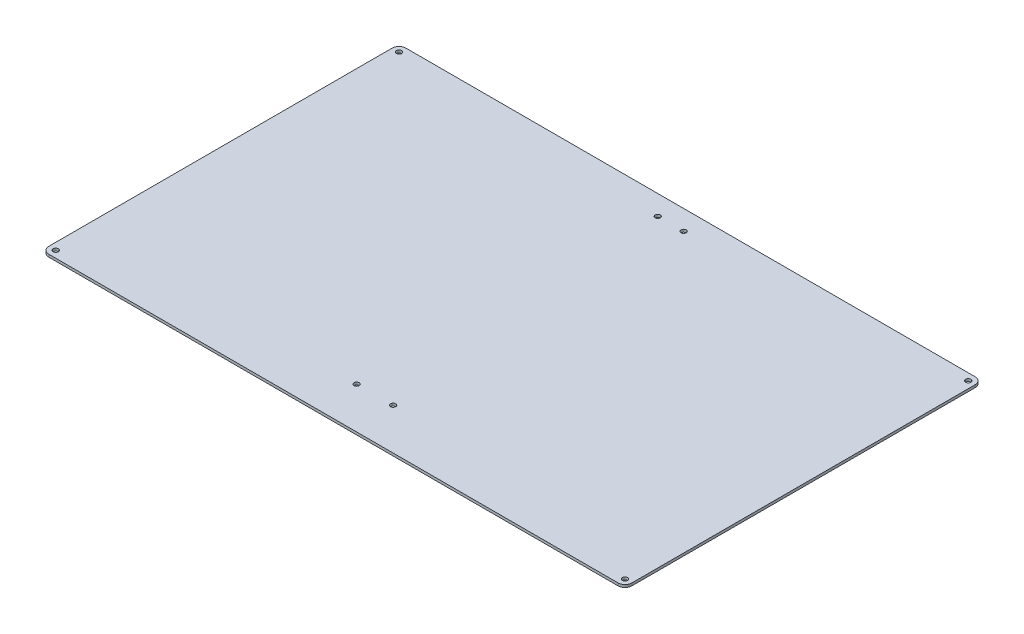
ISO-10303-21;
HEADER;
FILE_DESCRIPTION(('STEP AP214'),'2;1');
FILE_NAME('part.step','',(''),(''),'','','');
FILE_SCHEMA(('AUTOMOTIVE_DESIGN { 1 0 10303 214 1 1 1 1 }'));
ENDSEC;
DATA;
#1=APPLICATION_CONTEXT('core data for automotive mechanical design processes');
#2=APPLICATION_PROTOCOL_DEFINITION('international standard','automotive_design',2000,#1);
#3=PRODUCT_CONTEXT('',#1,'mechanical');
#4=PRODUCT('Part','Part','',(#3));
#5=PRODUCT_RELATED_PRODUCT_CATEGORY('part','',(#4));
#6=PRODUCT_DEFINITION_FORMATION('','',#4);
#7=PRODUCT_DEFINITION_CONTEXT('part definition',#1,'design');
#8=PRODUCT_DEFINITION('design','',#6,#7);
#9=PRODUCT_DEFINITION_SHAPE('','',#8);
#10=(LENGTH_UNIT() NAMED_UNIT(*) SI_UNIT(.MILLI.,.METRE.));
#11=(NAMED_UNIT(*) PLANE_ANGLE_UNIT() SI_UNIT($,.RADIAN.));
#12=(NAMED_UNIT(*) SI_UNIT($,.STERADIAN.) SOLID_ANGLE_UNIT());
#13=UNCERTAINTY_MEASURE_WITH_UNIT(LENGTH_MEASURE(1.E-05),#10,'distance_accuracy_value','');
#14=(GEOMETRIC_REPRESENTATION_CONTEXT(3) GLOBAL_UNCERTAINTY_ASSIGNED_CONTEXT((#13)) GLOBAL_UNIT_ASSIGNED_CONTEXT((#10,
#11,#12)) REPRESENTATION_CONTEXT('',''));
#15=CARTESIAN_POINT('',(0.,0.,0.));
#16=DIRECTION('',(0.,0.,1.));
#17=DIRECTION('',(1.,0.,0.));
#18=AXIS2_PLACEMENT_3D('',#15,#16,#17);
#19=CARTESIAN_POINT('',(-169.,1.5,-103.5));
#20=DIRECTION('',(1.,0.,0.));
#21=DIRECTION('',(0.,0.,-1.));
#22=AXIS2_PLACEMENT_3D('',#19,#20,#21);
#23=PLANE('',#22);
#24=DIRECTION('',(0.,0.,1.));
#25=VECTOR('',#24,1.);
#26=CARTESIAN_POINT('',(-169.,1.5,-103.5));
#27=LINE('',#26,#25);
#28=CARTESIAN_POINT('',(-169.,1.5,-99.4999999999999));
#29=VERTEX_POINT('',#28);
#30=CARTESIAN_POINT('',(-169.,1.5,99.5));
#31=VERTEX_POINT('',#30);
#32=EDGE_CURVE('E120',#29,#31,#27,.T.);
#33=ORIENTED_EDGE('',*,*,#32,.F.);
#34=DIRECTION('',(0.,-1.,0.));
#35=VECTOR('',#34,1.);
#36=CARTESIAN_POINT('',(-169.,1.5,-99.4999999999999));
#37=LINE('',#36,#35);
#38=CARTESIAN_POINT('',(-169.,0.,-99.4999999999999));
#39=VERTEX_POINT('',#38);
#40=EDGE_CURVE('E105',#29,#39,#37,.T.);
#41=ORIENTED_EDGE('',*,*,#40,.T.);
#42=DIRECTION('',(0.,0.,1.));
#43=VECTOR('',#42,1.);
#44=CARTESIAN_POINT('',(-169.,0.,-103.5));
#45=LINE('',#44,#43);
#46=CARTESIAN_POINT('',(-169.,0.,99.5));
#47=VERTEX_POINT('',#46);
#48=EDGE_CURVE('E117',#39,#47,#45,.T.);
#49=ORIENTED_EDGE('',*,*,#48,.T.);
#50=DIRECTION('',(0.,-1.,0.));
#51=VECTOR('',#50,1.);
#52=CARTESIAN_POINT('',(-169.,1.5,99.5));
#53=LINE('',#52,#51);
#54=EDGE_CURVE('E122',#47,#31,#53,.F.);
#55=ORIENTED_EDGE('',*,*,#54,.T.);
#56=EDGE_LOOP('',(#33,#41,#49,#55));
#57=FACE_BOUND('',#56,.T.);
#58=ADVANCED_FACE('F33',(#57),#23,.F.);
#59=CARTESIAN_POINT('',(-169.,1.5,103.5));
#60=DIRECTION('',(0.,0.,-1.));
#61=DIRECTION('',(-1.,0.,0.));
#62=AXIS2_PLACEMENT_3D('',#59,#60,#61);
#63=PLANE('',#62);
#64=DIRECTION('',(1.,0.,0.));
#65=VECTOR('',#64,1.);
#66=CARTESIAN_POINT('',(-169.,1.5,103.5));
#67=LINE('',#66,#65);
#68=CARTESIAN_POINT('',(-165.,1.5,103.5));
#69=VERTEX_POINT('',#68);
#70=CARTESIAN_POINT('',(165.,1.5,103.5));
#71=VERTEX_POINT('',#70);
#72=EDGE_CURVE('E192',#69,#71,#67,.T.);
#73=ORIENTED_EDGE('',*,*,#72,.F.);
#74=DIRECTION('',(0.,-1.,0.));
#75=VECTOR('',#74,1.);
#76=CARTESIAN_POINT('',(-165.,1.5,103.5));
#77=LINE('',#76,#75);
#78=CARTESIAN_POINT('',(-165.,0.,103.5));
#79=VERTEX_POINT('',#78);
#80=EDGE_CURVE('E159',#69,#79,#77,.T.);
#81=ORIENTED_EDGE('',*,*,#80,.T.);
#82=DIRECTION('',(1.,0.,0.));
#83=VECTOR('',#82,1.);
#84=CARTESIAN_POINT('',(-169.,0.,103.5));
#85=LINE('',#84,#83);
#86=CARTESIAN_POINT('',(165.,0.,103.5));
#87=VERTEX_POINT('',#86);
#88=EDGE_CURVE('E126',#79,#87,#85,.T.);
#89=ORIENTED_EDGE('',*,*,#88,.T.);
#90=DIRECTION('',(0.,-1.,0.));
#91=VECTOR('',#90,1.);
#92=CARTESIAN_POINT('',(165.,1.5,103.5));
#93=LINE('',#92,#91);
#94=EDGE_CURVE('E157',#87,#71,#93,.F.);
#95=ORIENTED_EDGE('',*,*,#94,.T.);
#96=EDGE_LOOP('',(#73,#81,#89,#95));
#97=FACE_BOUND('',#96,.T.);
#98=ADVANCED_FACE('F210',(#97),#63,.F.);
#99=CARTESIAN_POINT('',(169.,1.5,-103.5));
#100=DIRECTION('',(-1.,0.,0.));
#101=DIRECTION('',(0.,0.,1.));
#102=AXIS2_PLACEMENT_3D('',#99,#100,#101);
#103=PLANE('',#102);
#104=DIRECTION('',(0.,0.,-1.));
#105=VECTOR('',#104,1.);
#106=CARTESIAN_POINT('',(169.,1.5,-103.5));
#107=LINE('',#106,#105);
#108=CARTESIAN_POINT('',(169.,1.5,99.5));
#109=VERTEX_POINT('',#108);
#110=CARTESIAN_POINT('',(169.,1.5,-99.4999999999999));
#111=VERTEX_POINT('',#110);
#112=EDGE_CURVE('E193',#109,#111,#107,.T.);
#113=ORIENTED_EDGE('',*,*,#112,.F.);
#114=DIRECTION('',(0.,-1.,0.));
#115=VECTOR('',#114,1.);
#116=CARTESIAN_POINT('',(169.,1.5,99.5));
#117=LINE('',#116,#115);
#118=CARTESIAN_POINT('',(169.,0.,99.5));
#119=VERTEX_POINT('',#118);
#120=EDGE_CURVE('E11',#109,#119,#117,.T.);
#121=ORIENTED_EDGE('',*,*,#120,.T.);
#122=DIRECTION('',(0.,0.,-1.));
#123=VECTOR('',#122,1.);
#124=CARTESIAN_POINT('',(169.,0.,-103.5));
#125=LINE('',#124,#123);
#126=CARTESIAN_POINT('',(169.,0.,-99.4999999999999));
#127=VERTEX_POINT('',#126);
#128=EDGE_CURVE('E130',#119,#127,#125,.T.);
#129=ORIENTED_EDGE('',*,*,#128,.T.);
#130=DIRECTION('',(0.,-1.,0.));
#131=VECTOR('',#130,1.);
#132=CARTESIAN_POINT('',(169.,1.5,-99.4999999999999));
#133=LINE('',#132,#131);
#134=EDGE_CURVE('E42',#127,#111,#133,.F.);
#135=ORIENTED_EDGE('',*,*,#134,.T.);
#136=EDGE_LOOP('',(#113,#121,#129,#135));
#137=FACE_BOUND('',#136,.T.);
#138=ADVANCED_FACE('F203',(#137),#103,.F.);
#139=CARTESIAN_POINT('',(-169.,1.5,-103.5));
#140=DIRECTION('',(0.,0.,1.));
#141=DIRECTION('',(1.,0.,0.));
#142=AXIS2_PLACEMENT_3D('',#139,#140,#141);
#143=PLANE('',#142);
#144=DIRECTION('',(-1.,0.,0.));
#145=VECTOR('',#144,1.);
#146=CARTESIAN_POINT('',(-169.,0.,-103.5));
#147=LINE('',#146,#145);
#148=CARTESIAN_POINT('',(165.,0.,-103.5));
#149=VERTEX_POINT('',#148);
#150=CARTESIAN_POINT('',(-165.,0.,-103.5));
#151=VERTEX_POINT('',#150);
#152=EDGE_CURVE('E140',#149,#151,#147,.T.);
#153=ORIENTED_EDGE('',*,*,#152,.T.);
#154=DIRECTION('',(0.,-1.,0.));
#155=VECTOR('',#154,1.);
#156=CARTESIAN_POINT('',(-165.,1.5,-103.5));
#157=LINE('',#156,#155);
#158=CARTESIAN_POINT('',(-165.,1.5,-103.5));
#159=VERTEX_POINT('',#158);
#160=EDGE_CURVE('E106',#151,#159,#157,.F.);
#161=ORIENTED_EDGE('',*,*,#160,.T.);
#162=DIRECTION('',(-1.,0.,0.));
#163=VECTOR('',#162,1.);
#164=CARTESIAN_POINT('',(-169.,1.5,-103.5));
#165=LINE('',#164,#163);
#166=CARTESIAN_POINT('',(165.,1.5,-103.5));
#167=VERTEX_POINT('',#166);
#168=EDGE_CURVE('E136',#167,#159,#165,.T.);
#169=ORIENTED_EDGE('',*,*,#168,.F.);
#170=DIRECTION('',(0.,-1.,0.));
#171=VECTOR('',#170,1.);
#172=CARTESIAN_POINT('',(165.,1.5,-103.5));
#173=LINE('',#172,#171);
#174=EDGE_CURVE('E111',#167,#149,#173,.T.);
#175=ORIENTED_EDGE('',*,*,#174,.T.);
#176=EDGE_LOOP('',(#153,#161,#169,#175));
#177=FACE_BOUND('',#176,.T.);
#178=ADVANCED_FACE('F200',(#177),#143,.F.);
#179=CARTESIAN_POINT('',(0.,1.5,0.));
#180=DIRECTION('',(0.,1.,0.));
#181=DIRECTION('',(0.,0.,1.));
#182=AXIS2_PLACEMENT_3D('',#179,#180,#181);
#183=PLANE('',#182);
#184=CARTESIAN_POINT('',(-165.,1.5,99.5));
#185=DIRECTION('',(0.,1.,0.));
#186=DIRECTION('',(0.,0.,1.));
#187=AXIS2_PLACEMENT_3D('',#184,#185,#186);
#188=CIRCLE('',#187,1.5);
#189=CARTESIAN_POINT('',(-165.,1.5,101.));
#190=VERTEX_POINT('',#189);
#191=EDGE_CURVE('E274',#190,#190,#188,.T.);
#192=ORIENTED_EDGE('',*,*,#191,.F.);
#193=EDGE_LOOP('',(#192));
#194=FACE_BOUND('',#193,.T.);
#195=CARTESIAN_POINT('',(-165.,1.5,-99.4999999999999));
#196=DIRECTION('',(0.,1.,0.));
#197=DIRECTION('',(0.,0.,1.));
#198=AXIS2_PLACEMENT_3D('',#195,#196,#197);
#199=CIRCLE('',#198,1.5);
#200=CARTESIAN_POINT('',(-165.,1.5,-97.9999999999999));
#201=VERTEX_POINT('',#200);
#202=EDGE_CURVE('E277',#201,#201,#199,.T.);
#203=ORIENTED_EDGE('',*,*,#202,.F.);
#204=EDGE_LOOP('',(#203));
#205=FACE_BOUND('',#204,.T.);
#206=CARTESIAN_POINT('',(165.,1.5,-99.4999999999999));
#207=DIRECTION('',(0.,1.,0.));
#208=DIRECTION('',(0.,0.,1.));
#209=AXIS2_PLACEMENT_3D('',#206,#207,#208);
#210=CIRCLE('',#209,1.5);
#211=CARTESIAN_POINT('',(165.,1.5,-97.9999999999999));
#212=VERTEX_POINT('',#211);
#213=EDGE_CURVE('E285',#212,#212,#210,.T.);
#214=ORIENTED_EDGE('',*,*,#213,.F.);
#215=EDGE_LOOP('',(#214));
#216=FACE_BOUND('',#215,.T.);
#217=CARTESIAN_POINT('',(165.,1.5,99.5));
#218=DIRECTION('',(0.,1.,0.));
#219=DIRECTION('',(0.,0.,1.));
#220=AXIS2_PLACEMENT_3D('',#217,#218,#219);
#221=CIRCLE('',#220,1.5);
#222=CARTESIAN_POINT('',(165.,1.5,101.));
#223=VERTEX_POINT('',#222);
#224=EDGE_CURVE('E181',#223,#223,#221,.T.);
#225=ORIENTED_EDGE('',*,*,#224,.F.);
#226=EDGE_LOOP('',(#225));
#227=FACE_BOUND('',#226,.T.);
#228=CARTESIAN_POINT('',(-10.5778894472361,1.5,79.5));
#229=DIRECTION('',(0.,1.,0.));
#230=DIRECTION('',(0.,0.,1.));
#231=AXIS2_PLACEMENT_3D('',#228,#229,#230);
#232=CIRCLE('',#231,1.49999999999999);
#233=CARTESIAN_POINT('',(-10.5778894472361,1.5,81.));
#234=VERTEX_POINT('',#233);
#235=EDGE_CURVE('E169',#234,#234,#232,.T.);
#236=ORIENTED_EDGE('',*,*,#235,.F.);
#237=EDGE_LOOP('',(#236));
#238=FACE_BOUND('',#237,.T.);
#239=CARTESIAN_POINT('',(10.5778894472362,1.5,79.5));
#240=DIRECTION('',(0.,1.,0.));
#241=DIRECTION('',(0.,0.,1.));
#242=AXIS2_PLACEMENT_3D('',#239,#240,#241);
#243=CIRCLE('',#242,1.49999999999999);
#244=CARTESIAN_POINT('',(10.5778894472362,1.5,81.));
#245=VERTEX_POINT('',#244);
#246=EDGE_CURVE('E168',#245,#245,#243,.T.);
#247=ORIENTED_EDGE('',*,*,#246,.F.);
#248=EDGE_LOOP('',(#247));
#249=FACE_BOUND('',#248,.T.);
#250=CARTESIAN_POINT('',(-7.49999999999973,1.5,-92.0000000000002));
#251=DIRECTION('',(0.,1.,0.));
#252=DIRECTION('',(0.,0.,1.));
#253=AXIS2_PLACEMENT_3D('',#250,#251,#252);
#254=CIRCLE('',#253,1.49999999999999);
#255=CARTESIAN_POINT('',(-7.49999999999973,1.5,-90.5000000000003));
#256=VERTEX_POINT('',#255);
#257=EDGE_CURVE('E165',#256,#256,#254,.T.);
#258=ORIENTED_EDGE('',*,*,#257,.F.);
#259=EDGE_LOOP('',(#258));
#260=FACE_BOUND('',#259,.T.);
#261=CARTESIAN_POINT('',(7.50000000000012,1.5,-92.0000000000002));
#262=DIRECTION('',(0.,1.,0.));
#263=DIRECTION('',(0.,0.,1.));
#264=AXIS2_PLACEMENT_3D('',#261,#262,#263);
#265=CIRCLE('',#264,1.49999999999999);
#266=CARTESIAN_POINT('',(7.50000000000012,1.5,-90.5000000000003));
#267=VERTEX_POINT('',#266);
#268=EDGE_CURVE('E133',#267,#267,#265,.T.);
#269=ORIENTED_EDGE('',*,*,#268,.F.);
#270=EDGE_LOOP('',(#269));
#271=FACE_BOUND('',#270,.T.);
#272=ORIENTED_EDGE('',*,*,#168,.T.);
#273=CARTESIAN_POINT('',(-165.,1.5,-99.4999999999999));
#274=DIRECTION('',(0.,1.,0.));
#275=DIRECTION('',(0.,0.,1.));
#276=AXIS2_PLACEMENT_3D('',#273,#274,#275);
#277=CIRCLE('',#276,4.);
#278=EDGE_CURVE('E155',#159,#29,#277,.T.);
#279=ORIENTED_EDGE('',*,*,#278,.T.);
#280=ORIENTED_EDGE('',*,*,#32,.T.);
#281=CARTESIAN_POINT('',(-165.,1.5,99.5));
#282=DIRECTION('',(0.,1.,0.));
#283=DIRECTION('',(0.,0.,1.));
#284=AXIS2_PLACEMENT_3D('',#281,#282,#283);
#285=CIRCLE('',#284,4.);
#286=EDGE_CURVE('E153',#31,#69,#285,.T.);
#287=ORIENTED_EDGE('',*,*,#286,.T.);
#288=ORIENTED_EDGE('',*,*,#72,.T.);
#289=CARTESIAN_POINT('',(165.,1.5,99.5));
#290=DIRECTION('',(0.,1.,0.));
#291=DIRECTION('',(0.,0.,1.));
#292=AXIS2_PLACEMENT_3D('',#289,#290,#291);
#293=CIRCLE('',#292,4.);
#294=EDGE_CURVE('E56',#71,#109,#293,.T.);
#295=ORIENTED_EDGE('',*,*,#294,.T.);
#296=ORIENTED_EDGE('',*,*,#112,.T.);
#297=CARTESIAN_POINT('',(165.,1.5,-99.4999999999999));
#298=DIRECTION('',(0.,1.,0.));
#299=DIRECTION('',(0.,0.,1.));
#300=AXIS2_PLACEMENT_3D('',#297,#298,#299);
#301=CIRCLE('',#300,4.);
#302=EDGE_CURVE('E150',#111,#167,#301,.T.);
#303=ORIENTED_EDGE('',*,*,#302,.T.);
#304=EDGE_LOOP('',(#272,#279,#280,#287,#288,#295,#296,#303));
#305=FACE_BOUND('',#304,.T.);
#306=ADVANCED_FACE('F197',(#194,#205,#216,#227,#238,#249,#260,#271,#305),#183,.T.);
#307=CARTESIAN_POINT('',(0.,0.,0.));
#308=DIRECTION('',(0.,1.,0.));
#309=DIRECTION('',(0.,0.,1.));
#310=AXIS2_PLACEMENT_3D('',#307,#308,#309);
#311=PLANE('',#310);
#312=CARTESIAN_POINT('',(-165.,0.,99.5));
#313=DIRECTION('',(0.,1.,0.));
#314=DIRECTION('',(0.,0.,1.));
#315=AXIS2_PLACEMENT_3D('',#312,#313,#314);
#316=CIRCLE('',#315,1.49999999999999);
#317=CARTESIAN_POINT('',(-165.,0.,101.));
#318=VERTEX_POINT('',#317);
#319=EDGE_CURVE('E37',#318,#318,#316,.T.);
#320=ORIENTED_EDGE('',*,*,#319,.T.);
#321=EDGE_LOOP('',(#320));
#322=FACE_BOUND('',#321,.T.);
#323=CARTESIAN_POINT('',(-165.,0.,-99.4999999999999));
#324=DIRECTION('',(0.,1.,0.));
#325=DIRECTION('',(0.,0.,1.));
#326=AXIS2_PLACEMENT_3D('',#323,#324,#325);
#327=CIRCLE('',#326,1.49999999999999);
#328=CARTESIAN_POINT('',(-165.,0.,-98.));
#329=VERTEX_POINT('',#328);
#330=EDGE_CURVE('E279',#329,#329,#327,.T.);
#331=ORIENTED_EDGE('',*,*,#330,.T.);
#332=EDGE_LOOP('',(#331));
#333=FACE_BOUND('',#332,.T.);
#334=CARTESIAN_POINT('',(165.,0.,-99.4999999999999));
#335=DIRECTION('',(0.,1.,0.));
#336=DIRECTION('',(0.,0.,1.));
#337=AXIS2_PLACEMENT_3D('',#334,#335,#336);
#338=CIRCLE('',#337,1.49999999999999);
#339=CARTESIAN_POINT('',(165.,0.,-98.));
#340=VERTEX_POINT('',#339);
#341=EDGE_CURVE('E288',#340,#340,#338,.T.);
#342=ORIENTED_EDGE('',*,*,#341,.T.);
#343=EDGE_LOOP('',(#342));
#344=FACE_BOUND('',#343,.T.);
#345=CARTESIAN_POINT('',(165.,0.,99.5));
#346=DIRECTION('',(0.,1.,0.));
#347=DIRECTION('',(0.,0.,1.));
#348=AXIS2_PLACEMENT_3D('',#345,#346,#347);
#349=CIRCLE('',#348,1.49999999999999);
#350=CARTESIAN_POINT('',(165.,0.,101.));
#351=VERTEX_POINT('',#350);
#352=EDGE_CURVE('E176',#351,#351,#349,.T.);
#353=ORIENTED_EDGE('',*,*,#352,.T.);
#354=EDGE_LOOP('',(#353));
#355=FACE_BOUND('',#354,.T.);
#356=CARTESIAN_POINT('',(-10.5778894472361,0.,79.5));
#357=DIRECTION('',(0.,1.,0.));
#358=DIRECTION('',(0.,0.,1.));
#359=AXIS2_PLACEMENT_3D('',#356,#357,#358);
#360=CIRCLE('',#359,1.49999999999999);
#361=CARTESIAN_POINT('',(-10.5778894472361,0.,81.));
#362=VERTEX_POINT('',#361);
#363=EDGE_CURVE('E166',#362,#362,#360,.T.);
#364=ORIENTED_EDGE('',*,*,#363,.T.);
#365=EDGE_LOOP('',(#364));
#366=FACE_BOUND('',#365,.T.);
#367=CARTESIAN_POINT('',(10.5778894472362,0.,79.5));
#368=DIRECTION('',(0.,1.,0.));
#369=DIRECTION('',(0.,0.,1.));
#370=AXIS2_PLACEMENT_3D('',#367,#368,#369);
#371=CIRCLE('',#370,1.49999999999999);
#372=CARTESIAN_POINT('',(10.5778894472362,0.,81.));
#373=VERTEX_POINT('',#372);
#374=EDGE_CURVE('E173',#373,#373,#371,.T.);
#375=ORIENTED_EDGE('',*,*,#374,.T.);
#376=EDGE_LOOP('',(#375));
#377=FACE_BOUND('',#376,.T.);
#378=CARTESIAN_POINT('',(-7.49999999999973,0.,-92.0000000000002));
#379=DIRECTION('',(0.,1.,0.));
#380=DIRECTION('',(0.,0.,1.));
#381=AXIS2_PLACEMENT_3D('',#378,#379,#380);
#382=CIRCLE('',#381,1.49999999999999);
#383=CARTESIAN_POINT('',(-7.49999999999973,0.,-90.5000000000003));
#384=VERTEX_POINT('',#383);
#385=EDGE_CURVE('E163',#384,#384,#382,.T.);
#386=ORIENTED_EDGE('',*,*,#385,.T.);
#387=EDGE_LOOP('',(#386));
#388=FACE_BOUND('',#387,.T.);
#389=CARTESIAN_POINT('',(7.50000000000012,0.,-92.0000000000002));
#390=DIRECTION('',(0.,1.,0.));
#391=DIRECTION('',(0.,0.,1.));
#392=AXIS2_PLACEMENT_3D('',#389,#390,#391);
#393=CIRCLE('',#392,1.49999999999999);
#394=CARTESIAN_POINT('',(7.50000000000012,0.,-90.5000000000003));
#395=VERTEX_POINT('',#394);
#396=EDGE_CURVE('E127',#395,#395,#393,.T.);
#397=ORIENTED_EDGE('',*,*,#396,.T.);
#398=EDGE_LOOP('',(#397));
#399=FACE_BOUND('',#398,.T.);
#400=ORIENTED_EDGE('',*,*,#48,.F.);
#401=CARTESIAN_POINT('',(-165.,0.,-99.4999999999999));
#402=DIRECTION('',(0.,1.,0.));
#403=DIRECTION('',(0.,0.,1.));
#404=AXIS2_PLACEMENT_3D('',#401,#402,#403);
#405=CIRCLE('',#404,4.);
#406=EDGE_CURVE('E101',#39,#151,#405,.F.);
#407=ORIENTED_EDGE('',*,*,#406,.T.);
#408=ORIENTED_EDGE('',*,*,#152,.F.);
#409=CARTESIAN_POINT('',(165.,0.,-99.4999999999999));
#410=DIRECTION('',(0.,1.,0.));
#411=DIRECTION('',(0.,0.,1.));
#412=AXIS2_PLACEMENT_3D('',#409,#410,#411);
#413=CIRCLE('',#412,4.);
#414=EDGE_CURVE('E121',#149,#127,#413,.F.);
#415=ORIENTED_EDGE('',*,*,#414,.T.);
#416=ORIENTED_EDGE('',*,*,#128,.F.);
#417=CARTESIAN_POINT('',(165.,0.,99.5));
#418=DIRECTION('',(0.,1.,0.));
#419=DIRECTION('',(0.,0.,1.));
#420=AXIS2_PLACEMENT_3D('',#417,#418,#419);
#421=CIRCLE('',#420,4.);
#422=EDGE_CURVE('E144',#119,#87,#421,.F.);
#423=ORIENTED_EDGE('',*,*,#422,.T.);
#424=ORIENTED_EDGE('',*,*,#88,.F.);
#425=CARTESIAN_POINT('',(-165.,0.,99.5));
#426=DIRECTION('',(0.,1.,0.));
#427=DIRECTION('',(0.,0.,1.));
#428=AXIS2_PLACEMENT_3D('',#425,#426,#427);
#429=CIRCLE('',#428,4.);
#430=EDGE_CURVE('E112',#79,#47,#429,.F.);
#431=ORIENTED_EDGE('',*,*,#430,.T.);
#432=EDGE_LOOP('',(#400,#407,#408,#415,#416,#423,#424,#431));
#433=FACE_BOUND('',#432,.T.);
#434=ADVANCED_FACE('F124',(#322,#333,#344,#355,#366,#377,#388,#399,#433),#311,.F.);
#435=CARTESIAN_POINT('',(-165.,1.5,-99.4999999999999));
#436=DIRECTION('',(0.,-1.,0.));
#437=DIRECTION('',(0.,0.,-1.));
#438=AXIS2_PLACEMENT_3D('',#435,#436,#437);
#439=CYLINDRICAL_SURFACE('',#438,4.);
#440=ORIENTED_EDGE('',*,*,#278,.F.);
#441=ORIENTED_EDGE('',*,*,#160,.F.);
#442=ORIENTED_EDGE('',*,*,#406,.F.);
#443=ORIENTED_EDGE('',*,*,#40,.F.);
#444=EDGE_LOOP('',(#440,#441,#442,#443));
#445=FACE_BOUND('',#444,.T.);
#446=ADVANCED_FACE('F104',(#445),#439,.T.);
#447=CARTESIAN_POINT('',(-165.,1.5,99.5));
#448=DIRECTION('',(0.,-1.,0.));
#449=DIRECTION('',(0.,0.,-1.));
#450=AXIS2_PLACEMENT_3D('',#447,#448,#449);
#451=CYLINDRICAL_SURFACE('',#450,4.);
#452=ORIENTED_EDGE('',*,*,#286,.F.);
#453=ORIENTED_EDGE('',*,*,#54,.F.);
#454=ORIENTED_EDGE('',*,*,#430,.F.);
#455=ORIENTED_EDGE('',*,*,#80,.F.);
#456=EDGE_LOOP('',(#452,#453,#454,#455));
#457=FACE_BOUND('',#456,.T.);
#458=ADVANCED_FACE('F214',(#457),#451,.T.);
#459=CARTESIAN_POINT('',(165.,1.5,99.5));
#460=DIRECTION('',(0.,-1.,0.));
#461=DIRECTION('',(0.,0.,-1.));
#462=AXIS2_PLACEMENT_3D('',#459,#460,#461);
#463=CYLINDRICAL_SURFACE('',#462,4.);
#464=ORIENTED_EDGE('',*,*,#294,.F.);
#465=ORIENTED_EDGE('',*,*,#94,.F.);
#466=ORIENTED_EDGE('',*,*,#422,.F.);
#467=ORIENTED_EDGE('',*,*,#120,.F.);
#468=EDGE_LOOP('',(#464,#465,#466,#467));
#469=FACE_BOUND('',#468,.T.);
#470=ADVANCED_FACE('F206',(#469),#463,.T.);
#471=CARTESIAN_POINT('',(165.,1.5,-99.4999999999999));
#472=DIRECTION('',(0.,-1.,0.));
#473=DIRECTION('',(0.,0.,-1.));
#474=AXIS2_PLACEMENT_3D('',#471,#472,#473);
#475=CYLINDRICAL_SURFACE('',#474,4.);
#476=ORIENTED_EDGE('',*,*,#302,.F.);
#477=ORIENTED_EDGE('',*,*,#134,.F.);
#478=ORIENTED_EDGE('',*,*,#414,.F.);
#479=ORIENTED_EDGE('',*,*,#174,.F.);
#480=EDGE_LOOP('',(#476,#477,#478,#479));
#481=FACE_BOUND('',#480,.T.);
#482=ADVANCED_FACE('F35',(#481),#475,.T.);
#483=CARTESIAN_POINT('',(7.50000000000012,1.5,-92.0000000000002));
#484=DIRECTION('',(0.,1.,0.));
#485=DIRECTION('',(0.,0.,1.));
#486=AXIS2_PLACEMENT_3D('',#483,#484,#485);
#487=CYLINDRICAL_SURFACE('',#486,1.49999999999999);
#488=ORIENTED_EDGE('',*,*,#268,.T.);
#489=EDGE_LOOP('',(#488));
#490=FACE_BOUND('',#489,.T.);
#491=ORIENTED_EDGE('',*,*,#396,.F.);
#492=EDGE_LOOP('',(#491));
#493=FACE_BOUND('',#492,.T.);
#494=ADVANCED_FACE('F239',(#490,#493),#487,.F.);
#495=CARTESIAN_POINT('',(-7.49999999999973,1.5,-92.0000000000002));
#496=DIRECTION('',(0.,1.,0.));
#497=DIRECTION('',(0.,0.,1.));
#498=AXIS2_PLACEMENT_3D('',#495,#496,#497);
#499=CYLINDRICAL_SURFACE('',#498,1.49999999999999);
#500=ORIENTED_EDGE('',*,*,#257,.T.);
#501=EDGE_LOOP('',(#500));
#502=FACE_BOUND('',#501,.T.);
#503=ORIENTED_EDGE('',*,*,#385,.F.);
#504=EDGE_LOOP('',(#503));
#505=FACE_BOUND('',#504,.T.);
#506=ADVANCED_FACE('F242',(#502,#505),#499,.F.);
#507=CARTESIAN_POINT('',(10.5778894472362,1.5,79.5));
#508=DIRECTION('',(0.,1.,0.));
#509=DIRECTION('',(0.,0.,1.));
#510=AXIS2_PLACEMENT_3D('',#507,#508,#509);
#511=CYLINDRICAL_SURFACE('',#510,1.49999999999999);
#512=ORIENTED_EDGE('',*,*,#246,.T.);
#513=EDGE_LOOP('',(#512));
#514=FACE_BOUND('',#513,.T.);
#515=ORIENTED_EDGE('',*,*,#374,.F.);
#516=EDGE_LOOP('',(#515));
#517=FACE_BOUND('',#516,.T.);
#518=ADVANCED_FACE('F246',(#514,#517),#511,.F.);
#519=CARTESIAN_POINT('',(-10.5778894472361,1.5,79.5));
#520=DIRECTION('',(0.,1.,0.));
#521=DIRECTION('',(0.,0.,1.));
#522=AXIS2_PLACEMENT_3D('',#519,#520,#521);
#523=CYLINDRICAL_SURFACE('',#522,1.49999999999999);
#524=ORIENTED_EDGE('',*,*,#235,.T.);
#525=EDGE_LOOP('',(#524));
#526=FACE_BOUND('',#525,.T.);
#527=ORIENTED_EDGE('',*,*,#363,.F.);
#528=EDGE_LOOP('',(#527));
#529=FACE_BOUND('',#528,.T.);
#530=ADVANCED_FACE('F250',(#526,#529),#523,.F.);
#531=CARTESIAN_POINT('',(165.,1.5,99.5));
#532=DIRECTION('',(0.,1.,0.));
#533=DIRECTION('',(0.,0.,1.));
#534=AXIS2_PLACEMENT_3D('',#531,#532,#533);
#535=CYLINDRICAL_SURFACE('',#534,1.49999999999999);
#536=ORIENTED_EDGE('',*,*,#224,.T.);
#537=EDGE_LOOP('',(#536));
#538=FACE_BOUND('',#537,.T.);
#539=ORIENTED_EDGE('',*,*,#352,.F.);
#540=EDGE_LOOP('',(#539));
#541=FACE_BOUND('',#540,.T.);
#542=ADVANCED_FACE('F254',(#538,#541),#535,.F.);
#543=CARTESIAN_POINT('',(165.,1.5,-99.4999999999999));
#544=DIRECTION('',(0.,1.,0.));
#545=DIRECTION('',(0.,0.,1.));
#546=AXIS2_PLACEMENT_3D('',#543,#544,#545);
#547=CYLINDRICAL_SURFACE('',#546,1.49999999999999);
#548=ORIENTED_EDGE('',*,*,#213,.T.);
#549=EDGE_LOOP('',(#548));
#550=FACE_BOUND('',#549,.T.);
#551=ORIENTED_EDGE('',*,*,#341,.F.);
#552=EDGE_LOOP('',(#551));
#553=FACE_BOUND('',#552,.T.);
#554=ADVANCED_FACE('F257',(#550,#553),#547,.F.);
#555=CARTESIAN_POINT('',(-165.,1.5,-99.4999999999999));
#556=DIRECTION('',(0.,1.,0.));
#557=DIRECTION('',(0.,0.,1.));
#558=AXIS2_PLACEMENT_3D('',#555,#556,#557);
#559=CYLINDRICAL_SURFACE('',#558,1.49999999999999);
#560=ORIENTED_EDGE('',*,*,#202,.T.);
#561=EDGE_LOOP('',(#560));
#562=FACE_BOUND('',#561,.T.);
#563=ORIENTED_EDGE('',*,*,#330,.F.);
#564=EDGE_LOOP('',(#563));
#565=FACE_BOUND('',#564,.T.);
#566=ADVANCED_FACE('F261',(#562,#565),#559,.F.);
#567=CARTESIAN_POINT('',(-165.,1.5,99.5));
#568=DIRECTION('',(0.,1.,0.));
#569=DIRECTION('',(0.,0.,1.));
#570=AXIS2_PLACEMENT_3D('',#567,#568,#569);
#571=CYLINDRICAL_SURFACE('',#570,1.49999999999999);
#572=ORIENTED_EDGE('',*,*,#191,.T.);
#573=EDGE_LOOP('',(#572));
#574=FACE_BOUND('',#573,.T.);
#575=ORIENTED_EDGE('',*,*,#319,.F.);
#576=EDGE_LOOP('',(#575));
#577=FACE_BOUND('',#576,.T.);
#578=ADVANCED_FACE('F265',(#574,#577),#571,.F.);
#579=CLOSED_SHELL('',(#58,#98,#138,#178,#306,#434,#446,#458,#470,#482,#494,#506,#518,#530,#542,
#554,#566,#578));
#580=MANIFOLD_SOLID_BREP('B2',#579);
#581=ADVANCED_BREP_SHAPE_REPRESENTATION('',(#18,#580),#14);
#582=SHAPE_DEFINITION_REPRESENTATION(#9,#581);
ENDSEC;
END-ISO-10303-21;
